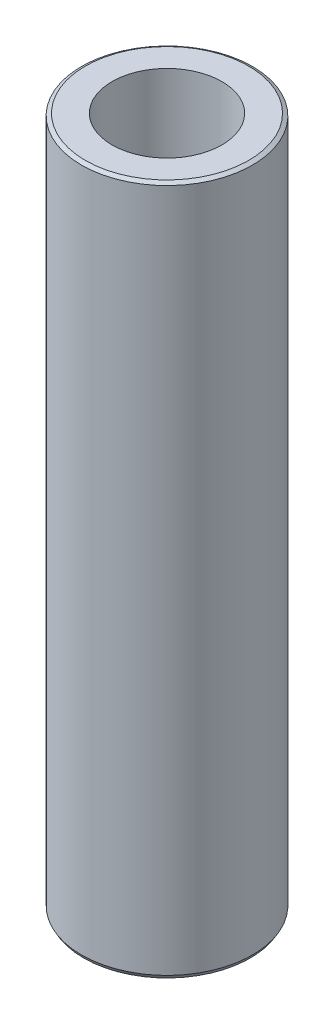
ISO-10303-21;
HEADER;
FILE_DESCRIPTION(('STEP AP214'),'2;1');
FILE_NAME('part.step','',(''),(''),'','','');
FILE_SCHEMA(('AUTOMOTIVE_DESIGN { 1 0 10303 214 1 1 1 1 }'));
ENDSEC;
DATA;
#1=APPLICATION_CONTEXT('core data for automotive mechanical design processes');
#2=APPLICATION_PROTOCOL_DEFINITION('international standard','automotive_design',2000,#1);
#3=PRODUCT_CONTEXT('',#1,'mechanical');
#4=PRODUCT('Part','Part','',(#3));
#5=PRODUCT_RELATED_PRODUCT_CATEGORY('part','',(#4));
#6=PRODUCT_DEFINITION_FORMATION('','',#4);
#7=PRODUCT_DEFINITION_CONTEXT('part definition',#1,'design');
#8=PRODUCT_DEFINITION('design','',#6,#7);
#9=PRODUCT_DEFINITION_SHAPE('','',#8);
#10=(LENGTH_UNIT() NAMED_UNIT(*) SI_UNIT(.MILLI.,.METRE.));
#11=(NAMED_UNIT(*) PLANE_ANGLE_UNIT() SI_UNIT($,.RADIAN.));
#12=(NAMED_UNIT(*) SI_UNIT($,.STERADIAN.) SOLID_ANGLE_UNIT());
#13=UNCERTAINTY_MEASURE_WITH_UNIT(LENGTH_MEASURE(1.E-05),#10,'distance_accuracy_value','');
#14=(GEOMETRIC_REPRESENTATION_CONTEXT(3) GLOBAL_UNCERTAINTY_ASSIGNED_CONTEXT((#13)) GLOBAL_UNIT_ASSIGNED_CONTEXT((#10,
#11,#12)) REPRESENTATION_CONTEXT('',''));
#15=CARTESIAN_POINT('',(0.,0.,0.));
#16=DIRECTION('',(0.,0.,1.));
#17=DIRECTION('',(1.,0.,0.));
#18=AXIS2_PLACEMENT_3D('',#15,#16,#17);
#19=CARTESIAN_POINT('',(0.,161.413607097138,0.));
#20=DIRECTION('',(0.,-1.,0.));
#21=DIRECTION('',(0.,0.,-1.));
#22=AXIS2_PLACEMENT_3D('',#19,#20,#21);
#23=CYLINDRICAL_SURFACE('',#22,20.);
#24=CARTESIAN_POINT('',(0.,160.901561205438,0.));
#25=DIRECTION('',(0.,1.,0.));
#26=DIRECTION('',(0.,0.,1.));
#27=AXIS2_PLACEMENT_3D('',#24,#25,#26);
#28=CIRCLE('',#27,20.);
#29=CARTESIAN_POINT('',(0.,160.901561205438,20.));
#30=VERTEX_POINT('',#29);
#31=EDGE_CURVE('E50',#30,#30,#28,.F.);
#32=ORIENTED_EDGE('',*,*,#31,.T.);
#33=EDGE_LOOP('',(#32));
#34=FACE_BOUND('',#33,.T.);
#35=CARTESIAN_POINT('',(0.,0.886889500231913,0.));
#36=DIRECTION('',(0.,1.,0.));
#37=DIRECTION('',(0.,0.,1.));
#38=AXIS2_PLACEMENT_3D('',#35,#36,#37);
#39=CIRCLE('',#38,20.);
#40=CARTESIAN_POINT('',(0.,0.886889500231913,20.));
#41=VERTEX_POINT('',#40);
#42=EDGE_CURVE('E51',#41,#41,#39,.T.);
#43=ORIENTED_EDGE('',*,*,#42,.T.);
#44=EDGE_LOOP('',(#43));
#45=FACE_BOUND('',#44,.T.);
#46=ADVANCED_FACE('F39',(#34,#45),#23,.T.);
#47=CARTESIAN_POINT('',(0.,161.413607097138,0.));
#48=DIRECTION('',(0.,1.,0.));
#49=DIRECTION('',(0.,0.,1.));
#50=AXIS2_PLACEMENT_3D('',#47,#48,#49);
#51=PLANE('',#50);
#52=CARTESIAN_POINT('',(0.,161.413607097138,0.));
#53=DIRECTION('',(0.,1.,0.));
#54=DIRECTION('',(0.,0.,1.));
#55=AXIS2_PLACEMENT_3D('',#52,#53,#54);
#56=CIRCLE('',#55,19.1131104997681);
#57=CARTESIAN_POINT('',(0.,161.413607097138,19.1131104997681));
#58=VERTEX_POINT('',#57);
#59=EDGE_CURVE('E54',#58,#58,#56,.T.);
#60=ORIENTED_EDGE('',*,*,#59,.T.);
#61=EDGE_LOOP('',(#60));
#62=FACE_BOUND('',#61,.T.);
#63=CARTESIAN_POINT('',(0.,161.413607097138,0.));
#64=DIRECTION('',(0.,1.,0.));
#65=DIRECTION('',(0.,0.,1.));
#66=AXIS2_PLACEMENT_3D('',#63,#64,#65);
#67=CIRCLE('',#66,12.8521842646716);
#68=CARTESIAN_POINT('',(0.,161.413607097138,12.8521842646716));
#69=VERTEX_POINT('',#68);
#70=EDGE_CURVE('E58',#69,#69,#67,.T.);
#71=ORIENTED_EDGE('',*,*,#70,.F.);
#72=EDGE_LOOP('',(#71));
#73=FACE_BOUND('',#72,.T.);
#74=ADVANCED_FACE('F69',(#62,#73),#51,.T.);
#75=CARTESIAN_POINT('',(0.,0.,0.));
#76=DIRECTION('',(0.,1.,0.));
#77=DIRECTION('',(0.,0.,1.));
#78=AXIS2_PLACEMENT_3D('',#75,#76,#77);
#79=PLANE('',#78);
#80=CARTESIAN_POINT('',(0.,0.,0.));
#81=DIRECTION('',(0.,1.,0.));
#82=DIRECTION('',(0.,0.,1.));
#83=AXIS2_PLACEMENT_3D('',#80,#81,#82);
#84=CIRCLE('',#83,19.4879541082996);
#85=CARTESIAN_POINT('',(0.,0.,19.4879541082996));
#86=VERTEX_POINT('',#85);
#87=EDGE_CURVE('E10',#86,#86,#84,.F.);
#88=ORIENTED_EDGE('',*,*,#87,.T.);
#89=EDGE_LOOP('',(#88));
#90=FACE_BOUND('',#89,.T.);
#91=CARTESIAN_POINT('',(0.,0.,0.));
#92=DIRECTION('',(0.,1.,0.));
#93=DIRECTION('',(0.,0.,1.));
#94=AXIS2_PLACEMENT_3D('',#91,#92,#93);
#95=CIRCLE('',#94,12.8521842646716);
#96=CARTESIAN_POINT('',(0.,0.,12.8521842646716));
#97=VERTEX_POINT('',#96);
#98=EDGE_CURVE('E63',#97,#97,#95,.T.);
#99=ORIENTED_EDGE('',*,*,#98,.T.);
#100=EDGE_LOOP('',(#99));
#101=FACE_BOUND('',#100,.T.);
#102=ADVANCED_FACE('F75',(#90,#101),#79,.F.);
#103=CARTESIAN_POINT('',(0.,161.413607097138,0.));
#104=DIRECTION('',(0.,-1.,0.));
#105=DIRECTION('',(0.,0.,-1.));
#106=AXIS2_PLACEMENT_3D('',#103,#104,#105);
#107=CYLINDRICAL_SURFACE('',#106,12.8521842646716);
#108=ORIENTED_EDGE('',*,*,#70,.T.);
#109=EDGE_LOOP('',(#108));
#110=FACE_BOUND('',#109,.T.);
#111=ORIENTED_EDGE('',*,*,#98,.F.);
#112=EDGE_LOOP('',(#111));
#113=FACE_BOUND('',#112,.T.);
#114=ADVANCED_FACE('F70',(#110,#113),#107,.F.);
#115=CARTESIAN_POINT('',(0.,161.413607097138,0.));
#116=DIRECTION('',(0.,-1.,0.));
#117=DIRECTION('',(0.,0.,-1.));
#118=AXIS2_PLACEMENT_3D('',#115,#116,#117);
#119=CONICAL_SURFACE('',#118,19.1131104997681,1.04719755119662);
#120=ORIENTED_EDGE('',*,*,#31,.F.);
#121=EDGE_LOOP('',(#120));
#122=FACE_BOUND('',#121,.T.);
#123=ORIENTED_EDGE('',*,*,#59,.F.);
#124=EDGE_LOOP('',(#123));
#125=FACE_BOUND('',#124,.T.);
#126=ADVANCED_FACE('F81',(#122,#125),#119,.T.);
#127=CARTESIAN_POINT('',(0.,0.886889500231913,0.));
#128=DIRECTION('',(0.,1.,0.));
#129=DIRECTION('',(0.,0.,1.));
#130=AXIS2_PLACEMENT_3D('',#127,#128,#129);
#131=CONICAL_SURFACE('',#130,20.,0.523598775598314);
#132=CARTESIAN_POINT('',(0.,0.,19.4879541082996));
#133=CARTESIAN_POINT('',(0.,0.00923843229408159,19.4932879196715));
#134=CARTESIAN_POINT('',(0.,0.0184768645881643,19.4986217310434));
#135=CARTESIAN_POINT('',(0.,0.0369537291763296,19.5092893537872));
#136=CARTESIAN_POINT('',(0.,0.0461921614704123,19.514623165159));
#137=CARTESIAN_POINT('',(0.,0.0646690260585772,19.5252907879028));
#138=CARTESIAN_POINT('',(0.,0.0739074583526594,19.5306245992747));
#139=CARTESIAN_POINT('',(0.,0.0923843229408241,19.5412922220184));
#140=CARTESIAN_POINT('',(0.,0.101622755234907,19.5466260333903));
#141=CARTESIAN_POINT('',(0.,0.120099619823071,19.5572936561341));
#142=CARTESIAN_POINT('',(0.,0.129338052117154,19.5626274675059));
#143=CARTESIAN_POINT('',(0.,0.147814916705319,19.5732950902497));
#144=CARTESIAN_POINT('',(0.,0.157053348999401,19.5786289016216));
#145=CARTESIAN_POINT('',(0.,0.175530213587566,19.5892965243653));
#146=CARTESIAN_POINT('',(0.,0.184768645881649,19.5946303357372));
#147=CARTESIAN_POINT('',(0.,0.203245510469813,19.605297958481));
#148=CARTESIAN_POINT('',(0.,0.212483942763895,19.6106317698528));
#149=CARTESIAN_POINT('',(0.,0.23096080735206,19.6212993925966));
#150=CARTESIAN_POINT('',(0.,0.240199239646143,19.6266332039685));
#151=CARTESIAN_POINT('',(0.,0.258676104234308,19.6373008267122));
#152=CARTESIAN_POINT('',(0.,0.26791453652839,19.6426346380841));
#153=CARTESIAN_POINT('',(0.,0.286391401116555,19.6533022608279));
#154=CARTESIAN_POINT('',(0.,0.295629833410638,19.6586360721998));
#155=CARTESIAN_POINT('',(0.,0.314106697998803,19.6693036949435));
#156=CARTESIAN_POINT('',(0.,0.323345130292885,19.6746375063154));
#157=CARTESIAN_POINT('',(0.,0.34182199488105,19.6853051290592));
#158=CARTESIAN_POINT('',(0.,0.351060427175132,19.690638940431));
#159=CARTESIAN_POINT('',(0.,0.369537291763298,19.7013065631748));
#160=CARTESIAN_POINT('',(0.,0.37877572405738,19.7066403745467));
#161=CARTESIAN_POINT('',(0.,0.397252588645544,19.7173079972904));
#162=CARTESIAN_POINT('',(0.,0.406491020939627,19.7226418086623));
#163=CARTESIAN_POINT('',(0.,0.424967885527792,19.7333094314061));
#164=CARTESIAN_POINT('',(0.,0.434206317821874,19.7386432427779));
#165=CARTESIAN_POINT('',(0.,0.452683182410039,19.7493108655217));
#166=CARTESIAN_POINT('',(0.,0.461921614704122,19.7546446768936));
#167=CARTESIAN_POINT('',(0.,0.480398479292286,19.7653122996373));
#168=CARTESIAN_POINT('',(0.,0.489636911586369,19.7706461110092));
#169=CARTESIAN_POINT('',(0.,0.508113776174534,19.781313733753));
#170=CARTESIAN_POINT('',(0.,0.517352208468616,19.7866475451249));
#171=CARTESIAN_POINT('',(0.,0.535829073056781,19.7973151678686));
#172=CARTESIAN_POINT('',(0.,0.545067505350864,19.8026489792405));
#173=CARTESIAN_POINT('',(0.,0.563544369939029,19.8133166019842));
#174=CARTESIAN_POINT('',(0.,0.572782802233111,19.8186504133561));
#175=CARTESIAN_POINT('',(0.,0.591259666821275,19.8293180360999));
#176=CARTESIAN_POINT('',(0.,0.600498099115358,19.8346518474718));
#177=CARTESIAN_POINT('',(0.,0.618974963703523,19.8453194702155));
#178=CARTESIAN_POINT('',(0.,0.628213395997605,19.8506532815874));
#179=CARTESIAN_POINT('',(0.,0.64669026058577,19.8613209043312));
#180=CARTESIAN_POINT('',(0.,0.655928692879853,19.866654715703));
#181=CARTESIAN_POINT('',(0.,0.674405557468018,19.8773223384468));
#182=CARTESIAN_POINT('',(0.,0.6836439897621,19.8826561498187));
#183=CARTESIAN_POINT('',(0.,0.702120854350265,19.8933237725624));
#184=CARTESIAN_POINT('',(0.,0.711359286644347,19.8986575839343));
#185=CARTESIAN_POINT('',(0.,0.729836151232512,19.9093252066781));
#186=CARTESIAN_POINT('',(0.,0.739074583526595,19.9146590180499));
#187=CARTESIAN_POINT('',(0.,0.75755144811476,19.9253266407937));
#188=CARTESIAN_POINT('',(0.,0.766789880408842,19.9306604521656));
#189=CARTESIAN_POINT('',(0.,0.785266744997006,19.9413280749093));
#190=CARTESIAN_POINT('',(0.,0.794505177291089,19.9466618862812));
#191=CARTESIAN_POINT('',(0.,0.812982041879254,19.957329509025));
#192=CARTESIAN_POINT('',(0.,0.822220474173336,19.9626633203968));
#193=CARTESIAN_POINT('',(0.,0.840697338761501,19.9733309431406));
#194=CARTESIAN_POINT('',(0.,0.849935771055583,19.9786647545125));
#195=CARTESIAN_POINT('',(0.,0.868412635643749,19.9893323772562));
#196=CARTESIAN_POINT('',(0.,0.877651067937832,19.9946661886281));
#197=CARTESIAN_POINT('',(0.,0.886889500231913,20.));
#198=B_SPLINE_CURVE_WITH_KNOTS('',3,(#132,#133,#134,#135,#136,#137,#138,#139,#140,#141,#142,
#143,#144,#145,#146,#147,#148,#149,#150,#151,#152,#153,#154,#155,#156,#157,#158,#159,#160,#161,
#162,#163,#164,#165,#166,#167,#168,#169,#170,#171,#172,#173,#174,#175,#176,#177,#178,#179,#180,
#181,#182,#183,#184,#185,#186,#187,#188,#189,#190,#191,#192,#193,#194,#195,#196,#197),
.UNSPECIFIED.,.F.,.F.,(4,2,2,2,2,2,2,2,2,2,2,2,2,2,2,2,2,2,2,2,2,2,2,2,2,2,2,2,2,2,2,2,4),(0.,
0.0320028682312725,0.0640057364625433,0.0960086046938158,0.128011472925088,0.160014341156361,
0.192017209387632,0.224020077618904,0.256022945850177,0.288025814081447,0.32002868231272,
0.352031550543992,0.384034418775265,0.416037287006536,0.448040155237808,0.480043023469081,
0.512045891700352,0.544048759931624,0.576051628162897,0.608054496394169,0.64005736462544,
0.672060232856712,0.704063101087985,0.736065969319257,0.768068837550528,0.800071705781801,
0.832074574013073,0.864077442244344,0.896080310475617,0.928083178706889,0.960086046938162,
0.992088915169432,1.0240917834007),.UNSPECIFIED.);
#199=EDGE_CURVE('BSEAM45',#86,#41,#198,.T.);
#200=ORIENTED_EDGE('',*,*,#87,.F.);
#201=ORIENTED_EDGE('',*,*,#42,.F.);
#202=ORIENTED_EDGE('',*,*,#199,.T.);
#203=ORIENTED_EDGE('',*,*,#199,.F.);
#204=EDGE_LOOP('',(#200,#202,#201,#203));
#205=FACE_BOUND('',#204,.T.);
#206=ADVANCED_FACE('F45',(#205),#131,.T.);
#207=CLOSED_SHELL('',(#46,#74,#102,#114,#126,#206));
#208=MANIFOLD_SOLID_BREP('B2',#207);
#209=ADVANCED_BREP_SHAPE_REPRESENTATION('',(#18,#208),#14);
#210=SHAPE_DEFINITION_REPRESENTATION(#9,#209);
ENDSEC;
END-ISO-10303-21;
